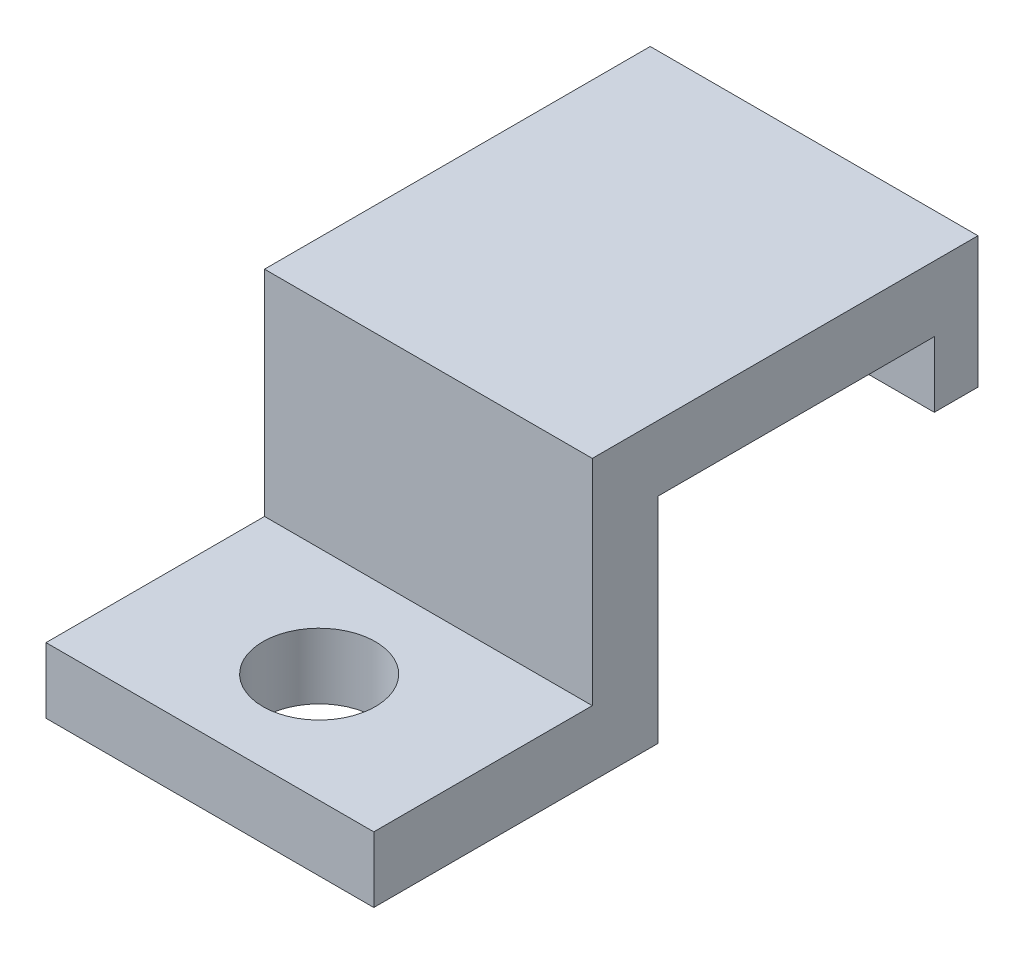
ISO-10303-21;
HEADER;
FILE_DESCRIPTION(('STEP AP214'),'2;1');
FILE_NAME('part.step','',(''),(''),'','','');
FILE_SCHEMA(('AUTOMOTIVE_DESIGN { 1 0 10303 214 1 1 1 1 }'));
ENDSEC;
DATA;
#1=APPLICATION_CONTEXT('core data for automotive mechanical design processes');
#2=APPLICATION_PROTOCOL_DEFINITION('international standard','automotive_design',2000,#1);
#3=PRODUCT_CONTEXT('',#1,'mechanical');
#4=PRODUCT('Part','Part','',(#3));
#5=PRODUCT_RELATED_PRODUCT_CATEGORY('part','',(#4));
#6=PRODUCT_DEFINITION_FORMATION('','',#4);
#7=PRODUCT_DEFINITION_CONTEXT('part definition',#1,'design');
#8=PRODUCT_DEFINITION('design','',#6,#7);
#9=PRODUCT_DEFINITION_SHAPE('','',#8);
#10=(LENGTH_UNIT() NAMED_UNIT(*) SI_UNIT(.MILLI.,.METRE.));
#11=(NAMED_UNIT(*) PLANE_ANGLE_UNIT() SI_UNIT($,.RADIAN.));
#12=(NAMED_UNIT(*) SI_UNIT($,.STERADIAN.) SOLID_ANGLE_UNIT());
#13=UNCERTAINTY_MEASURE_WITH_UNIT(LENGTH_MEASURE(1.E-05),#10,'distance_accuracy_value','');
#14=(GEOMETRIC_REPRESENTATION_CONTEXT(3) GLOBAL_UNCERTAINTY_ASSIGNED_CONTEXT((#13)) GLOBAL_UNIT_ASSIGNED_CONTEXT((#10,
#11,#12)) REPRESENTATION_CONTEXT('',''));
#15=CARTESIAN_POINT('',(0.,0.,0.));
#16=DIRECTION('',(0.,0.,1.));
#17=DIRECTION('',(1.,0.,0.));
#18=AXIS2_PLACEMENT_3D('',#15,#16,#17);
#19=CARTESIAN_POINT('',(15.,3.,0.));
#20=DIRECTION('',(0.,0.,-1.));
#21=DIRECTION('',(0.,1.,0.));
#22=AXIS2_PLACEMENT_3D('',#19,#20,#21);
#23=PLANE('',#22);
#24=DIRECTION('',(0.,-1.,0.));
#25=VECTOR('',#24,1.);
#26=CARTESIAN_POINT('',(0.,3.,0.));
#27=LINE('',#26,#25);
#28=CARTESIAN_POINT('',(0.,3.,0.));
#29=VERTEX_POINT('',#28);
#30=CARTESIAN_POINT('',(0.,0.,0.));
#31=VERTEX_POINT('',#30);
#32=EDGE_CURVE('E128',#29,#31,#27,.T.);
#33=ORIENTED_EDGE('',*,*,#32,.T.);
#34=DIRECTION('',(-1.,0.,0.));
#35=VECTOR('',#34,1.);
#36=CARTESIAN_POINT('',(15.,0.,0.));
#37=LINE('',#36,#35);
#38=CARTESIAN_POINT('',(15.,0.,0.));
#39=VERTEX_POINT('',#38);
#40=EDGE_CURVE('E11',#39,#31,#37,.T.);
#41=ORIENTED_EDGE('',*,*,#40,.F.);
#42=DIRECTION('',(0.,-1.,0.));
#43=VECTOR('',#42,1.);
#44=CARTESIAN_POINT('',(15.,3.,0.));
#45=LINE('',#44,#43);
#46=CARTESIAN_POINT('',(15.,3.,0.));
#47=VERTEX_POINT('',#46);
#48=EDGE_CURVE('E140',#47,#39,#45,.T.);
#49=ORIENTED_EDGE('',*,*,#48,.F.);
#50=DIRECTION('',(-1.,0.,0.));
#51=VECTOR('',#50,1.);
#52=CARTESIAN_POINT('',(15.,3.,0.));
#53=LINE('',#52,#51);
#54=EDGE_CURVE('E124',#47,#29,#53,.T.);
#55=ORIENTED_EDGE('',*,*,#54,.T.);
#56=EDGE_LOOP('',(#33,#41,#49,#55));
#57=FACE_BOUND('',#56,.T.);
#58=ADVANCED_FACE('F32',(#57),#23,.F.);
#59=CARTESIAN_POINT('',(15.,0.,0.));
#60=DIRECTION('',(0.,1.,0.));
#61=DIRECTION('',(0.,0.,1.));
#62=AXIS2_PLACEMENT_3D('',#59,#60,#61);
#63=PLANE('',#62);
#64=CARTESIAN_POINT('',(7.5,0.,-5.));
#65=DIRECTION('',(0.,1.,0.));
#66=DIRECTION('',(0.,0.,1.));
#67=AXIS2_PLACEMENT_3D('',#64,#65,#66);
#68=CIRCLE('',#67,2.575);
#69=CARTESIAN_POINT('',(7.5,0.,-2.425));
#70=VERTEX_POINT('',#69);
#71=EDGE_CURVE('E218',#70,#70,#68,.T.);
#72=ORIENTED_EDGE('',*,*,#71,.T.);
#73=EDGE_LOOP('',(#72));
#74=FACE_BOUND('',#73,.T.);
#75=DIRECTION('',(0.,0.,-1.));
#76=VECTOR('',#75,1.);
#77=CARTESIAN_POINT('',(0.,0.,0.));
#78=LINE('',#77,#76);
#79=CARTESIAN_POINT('',(0.,0.,-13.));
#80=VERTEX_POINT('',#79);
#81=EDGE_CURVE('E131',#31,#80,#78,.T.);
#82=ORIENTED_EDGE('',*,*,#81,.T.);
#83=DIRECTION('',(-1.,0.,0.));
#84=VECTOR('',#83,1.);
#85=CARTESIAN_POINT('',(15.,0.,-13.));
#86=LINE('',#85,#84);
#87=CARTESIAN_POINT('',(15.,0.,-13.));
#88=VERTEX_POINT('',#87);
#89=EDGE_CURVE('E41',#88,#80,#86,.T.);
#90=ORIENTED_EDGE('',*,*,#89,.F.);
#91=DIRECTION('',(0.,0.,-1.));
#92=VECTOR('',#91,1.);
#93=CARTESIAN_POINT('',(15.,0.,0.));
#94=LINE('',#93,#92);
#95=EDGE_CURVE('E88',#39,#88,#94,.T.);
#96=ORIENTED_EDGE('',*,*,#95,.F.);
#97=ORIENTED_EDGE('',*,*,#40,.T.);
#98=EDGE_LOOP('',(#82,#90,#96,#97));
#99=FACE_BOUND('',#98,.T.);
#100=ADVANCED_FACE('F238',(#74,#99),#63,.F.);
#101=CARTESIAN_POINT('',(15.,0.,-13.));
#102=DIRECTION('',(0.,0.,1.));
#103=DIRECTION('',(1.,0.,0.));
#104=AXIS2_PLACEMENT_3D('',#101,#102,#103);
#105=PLANE('',#104);
#106=DIRECTION('',(0.,1.,0.));
#107=VECTOR('',#106,1.);
#108=CARTESIAN_POINT('',(0.,0.,-13.));
#109=LINE('',#108,#107);
#110=CARTESIAN_POINT('',(0.,9.8,-13.));
#111=VERTEX_POINT('',#110);
#112=EDGE_CURVE('E134',#80,#111,#109,.T.);
#113=ORIENTED_EDGE('',*,*,#112,.T.);
#114=DIRECTION('',(-1.,0.,0.));
#115=VECTOR('',#114,1.);
#116=CARTESIAN_POINT('',(15.,9.8,-13.));
#117=LINE('',#116,#115);
#118=CARTESIAN_POINT('',(15.,9.8,-13.));
#119=VERTEX_POINT('',#118);
#120=EDGE_CURVE('E145',#119,#111,#117,.T.);
#121=ORIENTED_EDGE('',*,*,#120,.F.);
#122=DIRECTION('',(0.,1.,0.));
#123=VECTOR('',#122,1.);
#124=CARTESIAN_POINT('',(15.,0.,-13.));
#125=LINE('',#124,#123);
#126=EDGE_CURVE('E153',#88,#119,#125,.T.);
#127=ORIENTED_EDGE('',*,*,#126,.F.);
#128=ORIENTED_EDGE('',*,*,#89,.T.);
#129=EDGE_LOOP('',(#113,#121,#127,#128));
#130=FACE_BOUND('',#129,.T.);
#131=ADVANCED_FACE('F243',(#130),#105,.F.);
#132=CARTESIAN_POINT('',(15.,9.8,-13.));
#133=DIRECTION('',(0.,1.,0.));
#134=DIRECTION('',(0.,0.,1.));
#135=AXIS2_PLACEMENT_3D('',#132,#133,#134);
#136=PLANE('',#135);
#137=DIRECTION('',(0.,0.,-1.));
#138=VECTOR('',#137,1.);
#139=CARTESIAN_POINT('',(0.,9.8,-13.));
#140=LINE('',#139,#138);
#141=CARTESIAN_POINT('',(0.,9.8,-25.65));
#142=VERTEX_POINT('',#141);
#143=EDGE_CURVE('E136',#111,#142,#140,.T.);
#144=ORIENTED_EDGE('',*,*,#143,.T.);
#145=DIRECTION('',(-1.,0.,0.));
#146=VECTOR('',#145,1.);
#147=CARTESIAN_POINT('',(15.,9.8,-25.65));
#148=LINE('',#147,#146);
#149=CARTESIAN_POINT('',(15.,9.8,-25.65));
#150=VERTEX_POINT('',#149);
#151=EDGE_CURVE('E119',#150,#142,#148,.T.);
#152=ORIENTED_EDGE('',*,*,#151,.F.);
#153=DIRECTION('',(0.,0.,-1.));
#154=VECTOR('',#153,1.);
#155=CARTESIAN_POINT('',(15.,9.8,-13.));
#156=LINE('',#155,#154);
#157=EDGE_CURVE('E113',#119,#150,#156,.T.);
#158=ORIENTED_EDGE('',*,*,#157,.F.);
#159=ORIENTED_EDGE('',*,*,#120,.T.);
#160=EDGE_LOOP('',(#144,#152,#158,#159));
#161=FACE_BOUND('',#160,.T.);
#162=ADVANCED_FACE('F212',(#161),#136,.F.);
#163=CARTESIAN_POINT('',(15.,12.8,-25.65));
#164=DIRECTION('',(0.,-1.,0.));
#165=DIRECTION('',(0.,0.,-1.));
#166=AXIS2_PLACEMENT_3D('',#163,#164,#165);
#167=PLANE('',#166);
#168=DIRECTION('',(0.,0.,1.));
#169=VECTOR('',#168,1.);
#170=CARTESIAN_POINT('',(0.,12.8,-25.65));
#171=LINE('',#170,#169);
#172=CARTESIAN_POINT('',(0.,12.8,-27.65));
#173=VERTEX_POINT('',#172);
#174=CARTESIAN_POINT('',(0.,12.8,-10.));
#175=VERTEX_POINT('',#174);
#176=EDGE_CURVE('E118',#173,#175,#171,.T.);
#177=ORIENTED_EDGE('',*,*,#176,.T.);
#178=DIRECTION('',(-1.,0.,0.));
#179=VECTOR('',#178,1.);
#180=CARTESIAN_POINT('',(15.,12.8,-10.));
#181=LINE('',#180,#179);
#182=CARTESIAN_POINT('',(15.,12.8,-10.));
#183=VERTEX_POINT('',#182);
#184=EDGE_CURVE('E115',#183,#175,#181,.T.);
#185=ORIENTED_EDGE('',*,*,#184,.F.);
#186=DIRECTION('',(0.,0.,1.));
#187=VECTOR('',#186,1.);
#188=CARTESIAN_POINT('',(15.,12.8,-25.65));
#189=LINE('',#188,#187);
#190=CARTESIAN_POINT('',(15.,12.8,-27.65));
#191=VERTEX_POINT('',#190);
#192=EDGE_CURVE('E101',#191,#183,#189,.T.);
#193=ORIENTED_EDGE('',*,*,#192,.F.);
#194=DIRECTION('',(-1.,0.,0.));
#195=VECTOR('',#194,1.);
#196=CARTESIAN_POINT('',(15.,12.8,-27.65));
#197=LINE('',#196,#195);
#198=EDGE_CURVE('E176',#191,#173,#197,.T.);
#199=ORIENTED_EDGE('',*,*,#198,.T.);
#200=EDGE_LOOP('',(#177,#185,#193,#199));
#201=FACE_BOUND('',#200,.T.);
#202=ADVANCED_FACE('F116',(#201),#167,.F.);
#203=CARTESIAN_POINT('',(15.,12.8,-10.));
#204=DIRECTION('',(0.,0.,-1.));
#205=DIRECTION('',(0.,1.,0.));
#206=AXIS2_PLACEMENT_3D('',#203,#204,#205);
#207=PLANE('',#206);
#208=DIRECTION('',(0.,-1.,0.));
#209=VECTOR('',#208,1.);
#210=CARTESIAN_POINT('',(0.,12.8,-10.));
#211=LINE('',#210,#209);
#212=CARTESIAN_POINT('',(0.,3.,-10.));
#213=VERTEX_POINT('',#212);
#214=EDGE_CURVE('E74',#175,#213,#211,.T.);
#215=ORIENTED_EDGE('',*,*,#214,.T.);
#216=DIRECTION('',(-1.,0.,0.));
#217=VECTOR('',#216,1.);
#218=CARTESIAN_POINT('',(15.,3.,-10.));
#219=LINE('',#218,#217);
#220=CARTESIAN_POINT('',(15.,3.,-10.));
#221=VERTEX_POINT('',#220);
#222=EDGE_CURVE('E120',#221,#213,#219,.T.);
#223=ORIENTED_EDGE('',*,*,#222,.F.);
#224=DIRECTION('',(0.,-1.,0.));
#225=VECTOR('',#224,1.);
#226=CARTESIAN_POINT('',(15.,12.8,-10.));
#227=LINE('',#226,#225);
#228=EDGE_CURVE('E105',#183,#221,#227,.T.);
#229=ORIENTED_EDGE('',*,*,#228,.F.);
#230=ORIENTED_EDGE('',*,*,#184,.T.);
#231=EDGE_LOOP('',(#215,#223,#229,#230));
#232=FACE_BOUND('',#231,.T.);
#233=ADVANCED_FACE('F122',(#232),#207,.F.);
#234=CARTESIAN_POINT('',(15.,3.,-10.));
#235=DIRECTION('',(0.,-1.,0.));
#236=DIRECTION('',(0.,0.,-1.));
#237=AXIS2_PLACEMENT_3D('',#234,#235,#236);
#238=PLANE('',#237);
#239=CARTESIAN_POINT('',(7.5,3.,-5.));
#240=DIRECTION('',(0.,1.,0.));
#241=DIRECTION('',(0.,0.,1.));
#242=AXIS2_PLACEMENT_3D('',#239,#240,#241);
#243=CIRCLE('',#242,2.575);
#244=CARTESIAN_POINT('',(7.5,3.,-2.425));
#245=VERTEX_POINT('',#244);
#246=EDGE_CURVE('E173',#245,#245,#243,.T.);
#247=ORIENTED_EDGE('',*,*,#246,.F.);
#248=EDGE_LOOP('',(#247));
#249=FACE_BOUND('',#248,.T.);
#250=DIRECTION('',(0.,0.,1.));
#251=VECTOR('',#250,1.);
#252=CARTESIAN_POINT('',(0.,3.,-10.));
#253=LINE('',#252,#251);
#254=EDGE_CURVE('E80',#213,#29,#253,.T.);
#255=ORIENTED_EDGE('',*,*,#254,.T.);
#256=ORIENTED_EDGE('',*,*,#54,.F.);
#257=DIRECTION('',(0.,0.,1.));
#258=VECTOR('',#257,1.);
#259=CARTESIAN_POINT('',(15.,3.,-10.));
#260=LINE('',#259,#258);
#261=EDGE_CURVE('E50',#221,#47,#260,.T.);
#262=ORIENTED_EDGE('',*,*,#261,.F.);
#263=ORIENTED_EDGE('',*,*,#222,.T.);
#264=EDGE_LOOP('',(#255,#256,#262,#263));
#265=FACE_BOUND('',#264,.T.);
#266=ADVANCED_FACE('F227',(#249,#265),#238,.F.);
#267=CARTESIAN_POINT('',(15.,0.,0.));
#268=DIRECTION('',(1.,0.,0.));
#269=DIRECTION('',(0.,0.,-1.));
#270=AXIS2_PLACEMENT_3D('',#267,#268,#269);
#271=PLANE('',#270);
#272=ORIENTED_EDGE('',*,*,#48,.T.);
#273=ORIENTED_EDGE('',*,*,#95,.T.);
#274=ORIENTED_EDGE('',*,*,#126,.T.);
#275=ORIENTED_EDGE('',*,*,#157,.T.);
#276=DIRECTION('',(0.,-1.,0.));
#277=VECTOR('',#276,1.);
#278=CARTESIAN_POINT('',(15.,12.8,-25.65));
#279=LINE('',#278,#277);
#280=CARTESIAN_POINT('',(15.,6.8,-25.65));
#281=VERTEX_POINT('',#280);
#282=EDGE_CURVE('E162',#150,#281,#279,.T.);
#283=ORIENTED_EDGE('',*,*,#282,.T.);
#284=DIRECTION('',(0.,0.,-1.));
#285=VECTOR('',#284,1.);
#286=CARTESIAN_POINT('',(15.,6.8,-25.65));
#287=LINE('',#286,#285);
#288=CARTESIAN_POINT('',(15.,6.8,-27.65));
#289=VERTEX_POINT('',#288);
#290=EDGE_CURVE('E165',#281,#289,#287,.T.);
#291=ORIENTED_EDGE('',*,*,#290,.T.);
#292=DIRECTION('',(0.,1.,0.));
#293=VECTOR('',#292,1.);
#294=CARTESIAN_POINT('',(15.,12.8,-27.65));
#295=LINE('',#294,#293);
#296=EDGE_CURVE('E109',#289,#191,#295,.T.);
#297=ORIENTED_EDGE('',*,*,#296,.T.);
#298=ORIENTED_EDGE('',*,*,#192,.T.);
#299=ORIENTED_EDGE('',*,*,#228,.T.);
#300=ORIENTED_EDGE('',*,*,#261,.T.);
#301=EDGE_LOOP('',(#272,#273,#274,#275,#283,#291,#297,#298,#299,#300));
#302=FACE_BOUND('',#301,.T.);
#303=ADVANCED_FACE('F103',(#302),#271,.T.);
#304=CARTESIAN_POINT('',(0.,0.,0.));
#305=DIRECTION('',(1.,0.,0.));
#306=DIRECTION('',(0.,0.,-1.));
#307=AXIS2_PLACEMENT_3D('',#304,#305,#306);
#308=PLANE('',#307);
#309=ORIENTED_EDGE('',*,*,#32,.F.);
#310=ORIENTED_EDGE('',*,*,#254,.F.);
#311=ORIENTED_EDGE('',*,*,#214,.F.);
#312=ORIENTED_EDGE('',*,*,#176,.F.);
#313=DIRECTION('',(0.,1.,0.));
#314=VECTOR('',#313,1.);
#315=CARTESIAN_POINT('',(0.,12.8,-27.65));
#316=LINE('',#315,#314);
#317=CARTESIAN_POINT('',(0.,6.8,-27.65));
#318=VERTEX_POINT('',#317);
#319=EDGE_CURVE('E166',#318,#173,#316,.T.);
#320=ORIENTED_EDGE('',*,*,#319,.F.);
#321=DIRECTION('',(0.,0.,-1.));
#322=VECTOR('',#321,1.);
#323=CARTESIAN_POINT('',(0.,6.8,-25.65));
#324=LINE('',#323,#322);
#325=CARTESIAN_POINT('',(0.,6.8,-25.65));
#326=VERTEX_POINT('',#325);
#327=EDGE_CURVE('E179',#326,#318,#324,.T.);
#328=ORIENTED_EDGE('',*,*,#327,.F.);
#329=DIRECTION('',(0.,-1.,0.));
#330=VECTOR('',#329,1.);
#331=CARTESIAN_POINT('',(0.,12.8,-25.65));
#332=LINE('',#331,#330);
#333=EDGE_CURVE('E167',#142,#326,#332,.T.);
#334=ORIENTED_EDGE('',*,*,#333,.F.);
#335=ORIENTED_EDGE('',*,*,#143,.F.);
#336=ORIENTED_EDGE('',*,*,#112,.F.);
#337=ORIENTED_EDGE('',*,*,#81,.F.);
#338=EDGE_LOOP('',(#309,#310,#311,#312,#320,#328,#334,#335,#336,#337));
#339=FACE_BOUND('',#338,.T.);
#340=ADVANCED_FACE('F216',(#339),#308,.F.);
#341=CARTESIAN_POINT('',(15.,12.8,-25.65));
#342=DIRECTION('',(0.,0.,-1.));
#343=DIRECTION('',(-1.,0.,0.));
#344=AXIS2_PLACEMENT_3D('',#341,#342,#343);
#345=PLANE('',#344);
#346=ORIENTED_EDGE('',*,*,#282,.F.);
#347=ORIENTED_EDGE('',*,*,#151,.T.);
#348=ORIENTED_EDGE('',*,*,#333,.T.);
#349=DIRECTION('',(-1.,0.,0.));
#350=VECTOR('',#349,1.);
#351=CARTESIAN_POINT('',(15.,6.8,-25.65));
#352=LINE('',#351,#350);
#353=EDGE_CURVE('E132',#281,#326,#352,.T.);
#354=ORIENTED_EDGE('',*,*,#353,.F.);
#355=EDGE_LOOP('',(#346,#347,#348,#354));
#356=FACE_BOUND('',#355,.T.);
#357=ADVANCED_FACE('F201',(#356),#345,.F.);
#358=CARTESIAN_POINT('',(15.,6.8,-25.65));
#359=DIRECTION('',(0.,1.,0.));
#360=DIRECTION('',(0.,0.,1.));
#361=AXIS2_PLACEMENT_3D('',#358,#359,#360);
#362=PLANE('',#361);
#363=ORIENTED_EDGE('',*,*,#327,.T.);
#364=DIRECTION('',(-1.,0.,0.));
#365=VECTOR('',#364,1.);
#366=CARTESIAN_POINT('',(15.,6.8,-27.65));
#367=LINE('',#366,#365);
#368=EDGE_CURVE('E185',#289,#318,#367,.T.);
#369=ORIENTED_EDGE('',*,*,#368,.F.);
#370=ORIENTED_EDGE('',*,*,#290,.F.);
#371=ORIENTED_EDGE('',*,*,#353,.T.);
#372=EDGE_LOOP('',(#363,#369,#370,#371));
#373=FACE_BOUND('',#372,.T.);
#374=ADVANCED_FACE('F192',(#373),#362,.F.);
#375=CARTESIAN_POINT('',(15.,12.8,-27.65));
#376=DIRECTION('',(0.,0.,1.));
#377=DIRECTION('',(1.,0.,0.));
#378=AXIS2_PLACEMENT_3D('',#375,#376,#377);
#379=PLANE('',#378);
#380=ORIENTED_EDGE('',*,*,#319,.T.);
#381=ORIENTED_EDGE('',*,*,#198,.F.);
#382=ORIENTED_EDGE('',*,*,#296,.F.);
#383=ORIENTED_EDGE('',*,*,#368,.T.);
#384=EDGE_LOOP('',(#380,#381,#382,#383));
#385=FACE_BOUND('',#384,.T.);
#386=ADVANCED_FACE('F313',(#385),#379,.F.);
#387=CARTESIAN_POINT('',(7.5,0.,-5.));
#388=DIRECTION('',(0.,1.,0.));
#389=DIRECTION('',(0.,0.,1.));
#390=AXIS2_PLACEMENT_3D('',#387,#388,#389);
#391=CYLINDRICAL_SURFACE('',#390,2.575);
#392=ORIENTED_EDGE('',*,*,#71,.F.);
#393=EDGE_LOOP('',(#392));
#394=FACE_BOUND('',#393,.T.);
#395=ORIENTED_EDGE('',*,*,#246,.T.);
#396=EDGE_LOOP('',(#395));
#397=FACE_BOUND('',#396,.T.);
#398=ADVANCED_FACE('F225',(#394,#397),#391,.F.);
#399=CLOSED_SHELL('',(#58,#100,#131,#162,#202,#233,#266,#303,#340,#357,#374,#386,#398));
#400=MANIFOLD_SOLID_BREP('B2',#399);
#401=ADVANCED_BREP_SHAPE_REPRESENTATION('',(#18,#400),#14);
#402=SHAPE_DEFINITION_REPRESENTATION(#9,#401);
ENDSEC;
END-ISO-10303-21;
